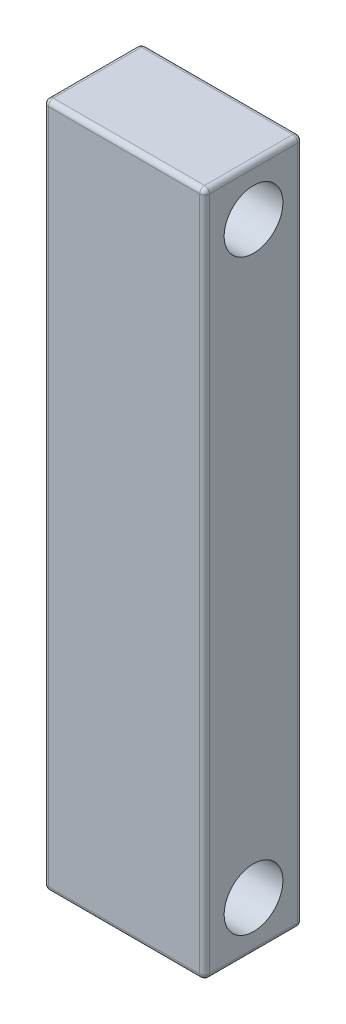
ISO-10303-21;
HEADER;
FILE_DESCRIPTION(('STEP AP214'),'2;1');
FILE_NAME('part.step','',(''),(''),'','','');
FILE_SCHEMA(('AUTOMOTIVE_DESIGN { 1 0 10303 214 1 1 1 1 }'));
ENDSEC;
DATA;
#1=APPLICATION_CONTEXT('core data for automotive mechanical design processes');
#2=APPLICATION_PROTOCOL_DEFINITION('international standard','automotive_design',2000,#1);
#3=PRODUCT_CONTEXT('',#1,'mechanical');
#4=PRODUCT('Part','Part','',(#3));
#5=PRODUCT_RELATED_PRODUCT_CATEGORY('part','',(#4));
#6=PRODUCT_DEFINITION_FORMATION('','',#4);
#7=PRODUCT_DEFINITION_CONTEXT('part definition',#1,'design');
#8=PRODUCT_DEFINITION('design','',#6,#7);
#9=PRODUCT_DEFINITION_SHAPE('','',#8);
#10=(LENGTH_UNIT() NAMED_UNIT(*) SI_UNIT(.MILLI.,.METRE.));
#11=(NAMED_UNIT(*) PLANE_ANGLE_UNIT() SI_UNIT($,.RADIAN.));
#12=(NAMED_UNIT(*) SI_UNIT($,.STERADIAN.) SOLID_ANGLE_UNIT());
#13=UNCERTAINTY_MEASURE_WITH_UNIT(LENGTH_MEASURE(1.E-05),#10,'distance_accuracy_value','');
#14=(GEOMETRIC_REPRESENTATION_CONTEXT(3) GLOBAL_UNCERTAINTY_ASSIGNED_CONTEXT((#13)) GLOBAL_UNIT_ASSIGNED_CONTEXT((#10,
#11,#12)) REPRESENTATION_CONTEXT('',''));
#15=CARTESIAN_POINT('',(0.,0.,0.));
#16=DIRECTION('',(0.,0.,1.));
#17=DIRECTION('',(1.,0.,0.));
#18=AXIS2_PLACEMENT_3D('',#15,#16,#17);
#19=CARTESIAN_POINT('',(16.45,70.,20.));
#20=DIRECTION('',(-1.,0.,0.));
#21=DIRECTION('',(0.,-1.,0.));
#22=AXIS2_PLACEMENT_3D('',#19,#20,#21);
#23=PLANE('',#22);
#24=DIRECTION('',(0.,1.,0.));
#25=VECTOR('',#24,1.);
#26=CARTESIAN_POINT('',(16.45,-70.,19.));
#27=LINE('',#26,#25);
#28=CARTESIAN_POINT('',(16.45,69.,19.));
#29=VERTEX_POINT('',#28);
#30=CARTESIAN_POINT('',(16.45,-69.,19.));
#31=VERTEX_POINT('',#30);
#32=EDGE_CURVE('E192',#29,#31,#27,.F.);
#33=ORIENTED_EDGE('',*,*,#32,.T.);
#34=DIRECTION('',(0.,0.,-1.));
#35=VECTOR('',#34,1.);
#36=CARTESIAN_POINT('',(16.45,-69.,20.));
#37=LINE('',#36,#35);
#38=CARTESIAN_POINT('',(16.45,-69.,1.));
#39=VERTEX_POINT('',#38);
#40=EDGE_CURVE('E196',#31,#39,#37,.T.);
#41=ORIENTED_EDGE('',*,*,#40,.T.);
#42=DIRECTION('',(0.,1.,0.));
#43=VECTOR('',#42,1.);
#44=CARTESIAN_POINT('',(16.45,70.,1.));
#45=LINE('',#44,#43);
#46=CARTESIAN_POINT('',(16.45,69.,1.));
#47=VERTEX_POINT('',#46);
#48=EDGE_CURVE('E194',#39,#47,#45,.T.);
#49=ORIENTED_EDGE('',*,*,#48,.T.);
#50=DIRECTION('',(0.,0.,-1.));
#51=VECTOR('',#50,1.);
#52=CARTESIAN_POINT('',(16.45,69.,20.));
#53=LINE('',#52,#51);
#54=EDGE_CURVE('E190',#47,#29,#53,.F.);
#55=ORIENTED_EDGE('',*,*,#54,.T.);
#56=EDGE_LOOP('',(#33,#41,#49,#55));
#57=FACE_BOUND('',#56,.T.);
#58=CARTESIAN_POINT('',(16.45,-60.,10.));
#59=DIRECTION('',(1.,0.,0.));
#60=DIRECTION('',(0.,1.,0.));
#61=AXIS2_PLACEMENT_3D('',#58,#59,#60);
#62=CIRCLE('',#61,6.);
#63=CARTESIAN_POINT('',(16.45,-54.,10.));
#64=VERTEX_POINT('',#63);
#65=EDGE_CURVE('E258',#64,#64,#62,.T.);
#66=ORIENTED_EDGE('',*,*,#65,.F.);
#67=EDGE_LOOP('',(#66));
#68=FACE_BOUND('',#67,.T.);
#69=CARTESIAN_POINT('',(16.45,60.,10.));
#70=DIRECTION('',(1.,0.,0.));
#71=DIRECTION('',(0.,1.,0.));
#72=AXIS2_PLACEMENT_3D('',#69,#70,#71);
#73=CIRCLE('',#72,6.);
#74=CARTESIAN_POINT('',(16.45,66.,10.));
#75=VERTEX_POINT('',#74);
#76=EDGE_CURVE('E157',#75,#75,#73,.T.);
#77=ORIENTED_EDGE('',*,*,#76,.F.);
#78=EDGE_LOOP('',(#77));
#79=FACE_BOUND('',#78,.T.);
#80=ADVANCED_FACE('F32',(#57,#68,#79),#23,.F.);
#81=CARTESIAN_POINT('',(-16.45,70.,20.));
#82=DIRECTION('',(0.,-1.,0.));
#83=DIRECTION('',(0.,0.,-1.));
#84=AXIS2_PLACEMENT_3D('',#81,#82,#83);
#85=PLANE('',#84);
#86=DIRECTION('',(-1.,0.,0.));
#87=VECTOR('',#86,1.);
#88=CARTESIAN_POINT('',(-16.45,70.,1.));
#89=LINE('',#88,#87);
#90=CARTESIAN_POINT('',(15.45,70.,1.));
#91=VERTEX_POINT('',#90);
#92=CARTESIAN_POINT('',(-15.45,70.,1.));
#93=VERTEX_POINT('',#92);
#94=EDGE_CURVE('E41',#91,#93,#89,.T.);
#95=ORIENTED_EDGE('',*,*,#94,.T.);
#96=DIRECTION('',(0.,0.,-1.));
#97=VECTOR('',#96,1.);
#98=CARTESIAN_POINT('',(-15.45,70.,20.));
#99=LINE('',#98,#97);
#100=CARTESIAN_POINT('',(-15.45,70.,19.));
#101=VERTEX_POINT('',#100);
#102=EDGE_CURVE('E11',#93,#101,#99,.F.);
#103=ORIENTED_EDGE('',*,*,#102,.T.);
#104=DIRECTION('',(-1.,0.,0.));
#105=VECTOR('',#104,1.);
#106=CARTESIAN_POINT('',(16.45,70.,19.));
#107=LINE('',#106,#105);
#108=CARTESIAN_POINT('',(15.45,70.,19.));
#109=VERTEX_POINT('',#108);
#110=EDGE_CURVE('E201',#101,#109,#107,.F.);
#111=ORIENTED_EDGE('',*,*,#110,.T.);
#112=DIRECTION('',(0.,0.,-1.));
#113=VECTOR('',#112,1.);
#114=CARTESIAN_POINT('',(15.45,70.,20.));
#115=LINE('',#114,#113);
#116=EDGE_CURVE('E199',#109,#91,#115,.T.);
#117=ORIENTED_EDGE('',*,*,#116,.T.);
#118=EDGE_LOOP('',(#95,#103,#111,#117));
#119=FACE_BOUND('',#118,.T.);
#120=ADVANCED_FACE('F277',(#119),#85,.F.);
#121=CARTESIAN_POINT('',(-16.45,70.,20.));
#122=DIRECTION('',(1.,0.,0.));
#123=DIRECTION('',(0.,1.,0.));
#124=AXIS2_PLACEMENT_3D('',#121,#122,#123);
#125=PLANE('',#124);
#126=DIRECTION('',(0.,0.,-1.));
#127=VECTOR('',#126,1.);
#128=CARTESIAN_POINT('',(-16.45,69.,20.));
#129=LINE('',#128,#127);
#130=CARTESIAN_POINT('',(-16.45,69.,19.));
#131=VERTEX_POINT('',#130);
#132=CARTESIAN_POINT('',(-16.45,69.,1.));
#133=VERTEX_POINT('',#132);
#134=EDGE_CURVE('E127',#131,#133,#129,.T.);
#135=ORIENTED_EDGE('',*,*,#134,.T.);
#136=DIRECTION('',(0.,-1.,0.));
#137=VECTOR('',#136,1.);
#138=CARTESIAN_POINT('',(-16.45,70.,1.));
#139=LINE('',#138,#137);
#140=CARTESIAN_POINT('',(-16.45,-69.,1.));
#141=VERTEX_POINT('',#140);
#142=EDGE_CURVE('E162',#133,#141,#139,.T.);
#143=ORIENTED_EDGE('',*,*,#142,.T.);
#144=DIRECTION('',(0.,0.,-1.));
#145=VECTOR('',#144,1.);
#146=CARTESIAN_POINT('',(-16.45,-69.,20.));
#147=LINE('',#146,#145);
#148=CARTESIAN_POINT('',(-16.45,-69.,19.));
#149=VERTEX_POINT('',#148);
#150=EDGE_CURVE('E130',#141,#149,#147,.F.);
#151=ORIENTED_EDGE('',*,*,#150,.T.);
#152=DIRECTION('',(0.,-1.,0.));
#153=VECTOR('',#152,1.);
#154=CARTESIAN_POINT('',(-16.45,70.,19.));
#155=LINE('',#154,#153);
#156=EDGE_CURVE('E122',#149,#131,#155,.F.);
#157=ORIENTED_EDGE('',*,*,#156,.T.);
#158=EDGE_LOOP('',(#135,#143,#151,#157));
#159=FACE_BOUND('',#158,.T.);
#160=CARTESIAN_POINT('',(-16.45,-60.,10.));
#161=DIRECTION('',(1.,0.,0.));
#162=DIRECTION('',(0.,1.,0.));
#163=AXIS2_PLACEMENT_3D('',#160,#161,#162);
#164=CIRCLE('',#163,6.);
#165=CARTESIAN_POINT('',(-16.45,-54.,10.));
#166=VERTEX_POINT('',#165);
#167=EDGE_CURVE('E264',#166,#166,#164,.T.);
#168=ORIENTED_EDGE('',*,*,#167,.T.);
#169=EDGE_LOOP('',(#168));
#170=FACE_BOUND('',#169,.T.);
#171=CARTESIAN_POINT('',(-16.45,60.,10.));
#172=DIRECTION('',(1.,0.,0.));
#173=DIRECTION('',(0.,1.,0.));
#174=AXIS2_PLACEMENT_3D('',#171,#172,#173);
#175=CIRCLE('',#174,6.);
#176=CARTESIAN_POINT('',(-16.45,66.,10.));
#177=VERTEX_POINT('',#176);
#178=EDGE_CURVE('E154',#177,#177,#175,.T.);
#179=ORIENTED_EDGE('',*,*,#178,.T.);
#180=EDGE_LOOP('',(#179));
#181=FACE_BOUND('',#180,.T.);
#182=ADVANCED_FACE('F124',(#159,#170,#181),#125,.F.);
#183=CARTESIAN_POINT('',(-16.45,-70.,20.));
#184=DIRECTION('',(0.,1.,0.));
#185=DIRECTION('',(0.,0.,1.));
#186=AXIS2_PLACEMENT_3D('',#183,#184,#185);
#187=PLANE('',#186);
#188=DIRECTION('',(1.,0.,0.));
#189=VECTOR('',#188,1.);
#190=CARTESIAN_POINT('',(-16.45,-70.,19.));
#191=LINE('',#190,#189);
#192=CARTESIAN_POINT('',(15.45,-70.,19.));
#193=VERTEX_POINT('',#192);
#194=CARTESIAN_POINT('',(-15.45,-70.,19.));
#195=VERTEX_POINT('',#194);
#196=EDGE_CURVE('E175',#193,#195,#191,.F.);
#197=ORIENTED_EDGE('',*,*,#196,.T.);
#198=DIRECTION('',(0.,0.,-1.));
#199=VECTOR('',#198,1.);
#200=CARTESIAN_POINT('',(-15.45,-70.,20.));
#201=LINE('',#200,#199);
#202=CARTESIAN_POINT('',(-15.45,-70.,1.));
#203=VERTEX_POINT('',#202);
#204=EDGE_CURVE('E179',#195,#203,#201,.T.);
#205=ORIENTED_EDGE('',*,*,#204,.T.);
#206=DIRECTION('',(1.,0.,0.));
#207=VECTOR('',#206,1.);
#208=CARTESIAN_POINT('',(-16.45,-70.,1.));
#209=LINE('',#208,#207);
#210=CARTESIAN_POINT('',(15.45,-70.,1.));
#211=VERTEX_POINT('',#210);
#212=EDGE_CURVE('E177',#203,#211,#209,.T.);
#213=ORIENTED_EDGE('',*,*,#212,.T.);
#214=DIRECTION('',(0.,0.,-1.));
#215=VECTOR('',#214,1.);
#216=CARTESIAN_POINT('',(15.45,-70.,20.));
#217=LINE('',#216,#215);
#218=EDGE_CURVE('E173',#211,#193,#217,.F.);
#219=ORIENTED_EDGE('',*,*,#218,.T.);
#220=EDGE_LOOP('',(#197,#205,#213,#219));
#221=FACE_BOUND('',#220,.T.);
#222=ADVANCED_FACE('F398',(#221),#187,.F.);
#223=CARTESIAN_POINT('',(0.,0.,20.));
#224=DIRECTION('',(0.,0.,1.));
#225=DIRECTION('',(1.,0.,0.));
#226=AXIS2_PLACEMENT_3D('',#223,#224,#225);
#227=PLANE('',#226);
#228=DIRECTION('',(0.,-1.,0.));
#229=VECTOR('',#228,1.);
#230=CARTESIAN_POINT('',(-15.45,-70.,20.));
#231=LINE('',#230,#229);
#232=CARTESIAN_POINT('',(-15.45,69.,20.));
#233=VERTEX_POINT('',#232);
#234=CARTESIAN_POINT('',(-15.45,-69.,20.));
#235=VERTEX_POINT('',#234);
#236=EDGE_CURVE('E139',#233,#235,#231,.T.);
#237=ORIENTED_EDGE('',*,*,#236,.T.);
#238=DIRECTION('',(1.,0.,0.));
#239=VECTOR('',#238,1.);
#240=CARTESIAN_POINT('',(16.45,-69.,20.));
#241=LINE('',#240,#239);
#242=CARTESIAN_POINT('',(15.45,-69.,20.));
#243=VERTEX_POINT('',#242);
#244=EDGE_CURVE('E187',#235,#243,#241,.T.);
#245=ORIENTED_EDGE('',*,*,#244,.T.);
#246=DIRECTION('',(0.,1.,0.));
#247=VECTOR('',#246,1.);
#248=CARTESIAN_POINT('',(15.45,70.,20.));
#249=LINE('',#248,#247);
#250=CARTESIAN_POINT('',(15.45,69.,20.));
#251=VERTEX_POINT('',#250);
#252=EDGE_CURVE('E184',#243,#251,#249,.T.);
#253=ORIENTED_EDGE('',*,*,#252,.T.);
#254=DIRECTION('',(-1.,0.,0.));
#255=VECTOR('',#254,1.);
#256=CARTESIAN_POINT('',(-16.45,69.,20.));
#257=LINE('',#256,#255);
#258=EDGE_CURVE('E182',#251,#233,#257,.T.);
#259=ORIENTED_EDGE('',*,*,#258,.T.);
#260=EDGE_LOOP('',(#237,#245,#253,#259));
#261=FACE_BOUND('',#260,.T.);
#262=ADVANCED_FACE('F361',(#261),#227,.T.);
#263=CARTESIAN_POINT('',(0.,0.,0.));
#264=DIRECTION('',(0.,0.,1.));
#265=DIRECTION('',(1.,0.,0.));
#266=AXIS2_PLACEMENT_3D('',#263,#264,#265);
#267=PLANE('',#266);
#268=DIRECTION('',(1.,0.,0.));
#269=VECTOR('',#268,1.);
#270=CARTESIAN_POINT('',(0.,-69.,0.));
#271=LINE('',#270,#269);
#272=CARTESIAN_POINT('',(15.45,-69.,0.));
#273=VERTEX_POINT('',#272);
#274=CARTESIAN_POINT('',(-15.45,-69.,0.));
#275=VERTEX_POINT('',#274);
#276=EDGE_CURVE('E168',#273,#275,#271,.F.);
#277=ORIENTED_EDGE('',*,*,#276,.T.);
#278=DIRECTION('',(0.,-1.,0.));
#279=VECTOR('',#278,1.);
#280=CARTESIAN_POINT('',(-15.45,0.,0.));
#281=LINE('',#280,#279);
#282=CARTESIAN_POINT('',(-15.45,69.,0.));
#283=VERTEX_POINT('',#282);
#284=EDGE_CURVE('E170',#275,#283,#281,.F.);
#285=ORIENTED_EDGE('',*,*,#284,.T.);
#286=DIRECTION('',(-1.,0.,0.));
#287=VECTOR('',#286,1.);
#288=CARTESIAN_POINT('',(0.,69.,0.));
#289=LINE('',#288,#287);
#290=CARTESIAN_POINT('',(15.45,69.,0.));
#291=VERTEX_POINT('',#290);
#292=EDGE_CURVE('E166',#283,#291,#289,.F.);
#293=ORIENTED_EDGE('',*,*,#292,.T.);
#294=DIRECTION('',(0.,1.,0.));
#295=VECTOR('',#294,1.);
#296=CARTESIAN_POINT('',(15.45,0.,0.));
#297=LINE('',#296,#295);
#298=EDGE_CURVE('E164',#291,#273,#297,.F.);
#299=ORIENTED_EDGE('',*,*,#298,.T.);
#300=EDGE_LOOP('',(#277,#285,#293,#299));
#301=FACE_BOUND('',#300,.T.);
#302=ADVANCED_FACE('F389',(#301),#267,.F.);
#303=CARTESIAN_POINT('',(-16.45,60.,10.));
#304=DIRECTION('',(1.,0.,0.));
#305=DIRECTION('',(0.,1.,0.));
#306=AXIS2_PLACEMENT_3D('',#303,#304,#305);
#307=CYLINDRICAL_SURFACE('',#306,6.);
#308=ORIENTED_EDGE('',*,*,#178,.F.);
#309=EDGE_LOOP('',(#308));
#310=FACE_BOUND('',#309,.T.);
#311=ORIENTED_EDGE('',*,*,#76,.T.);
#312=EDGE_LOOP('',(#311));
#313=FACE_BOUND('',#312,.T.);
#314=ADVANCED_FACE('F274',(#310,#313),#307,.F.);
#315=CARTESIAN_POINT('',(-16.45,-60.,10.));
#316=DIRECTION('',(1.,0.,0.));
#317=DIRECTION('',(0.,1.,0.));
#318=AXIS2_PLACEMENT_3D('',#315,#316,#317);
#319=CYLINDRICAL_SURFACE('',#318,6.);
#320=ORIENTED_EDGE('',*,*,#167,.F.);
#321=EDGE_LOOP('',(#320));
#322=FACE_BOUND('',#321,.T.);
#323=ORIENTED_EDGE('',*,*,#65,.T.);
#324=EDGE_LOOP('',(#323));
#325=FACE_BOUND('',#324,.T.);
#326=ADVANCED_FACE('F356',(#322,#325),#319,.F.);
#327=CARTESIAN_POINT('',(15.45,0.,19.));
#328=DIRECTION('',(0.,-1.,0.));
#329=DIRECTION('',(1.,0.,0.));
#330=AXIS2_PLACEMENT_3D('',#327,#328,#329);
#331=CYLINDRICAL_SURFACE('',#330,1.);
#332=CARTESIAN_POINT('',(15.45,69.,19.));
#333=DIRECTION('',(0.,1.,0.));
#334=DIRECTION('',(0.,0.,1.));
#335=AXIS2_PLACEMENT_3D('',#332,#333,#334);
#336=CIRCLE('',#335,1.);
#337=EDGE_CURVE('E36',#251,#29,#336,.T.);
#338=ORIENTED_EDGE('',*,*,#337,.F.);
#339=ORIENTED_EDGE('',*,*,#252,.F.);
#340=CARTESIAN_POINT('',(15.45,-69.,19.));
#341=DIRECTION('',(0.,-1.,0.));
#342=DIRECTION('',(0.,0.,-1.));
#343=AXIS2_PLACEMENT_3D('',#340,#341,#342);
#344=CIRCLE('',#343,1.);
#345=EDGE_CURVE('E250',#31,#243,#344,.T.);
#346=ORIENTED_EDGE('',*,*,#345,.F.);
#347=ORIENTED_EDGE('',*,*,#32,.F.);
#348=EDGE_LOOP('',(#338,#339,#346,#347));
#349=FACE_BOUND('',#348,.T.);
#350=ADVANCED_FACE('F34',(#349),#331,.T.);
#351=CARTESIAN_POINT('',(15.45,69.,19.));
#352=DIRECTION('',(0.,0.,1.));
#353=DIRECTION('',(1.,0.,0.));
#354=AXIS2_PLACEMENT_3D('',#351,#352,#353);
#355=SPHERICAL_SURFACE('',#354,1.);
#356=CARTESIAN_POINT('',(15.45,69.,19.));
#357=DIRECTION('',(1.,0.,0.));
#358=DIRECTION('',(0.,0.,-1.));
#359=AXIS2_PLACEMENT_3D('',#356,#357,#358);
#360=CIRCLE('',#359,1.);
#361=EDGE_CURVE('E245',#251,#109,#360,.F.);
#362=ORIENTED_EDGE('',*,*,#361,.F.);
#363=ORIENTED_EDGE('',*,*,#337,.T.);
#364=CARTESIAN_POINT('',(15.45,69.,19.));
#365=DIRECTION('',(0.,0.,1.));
#366=DIRECTION('',(1.,0.,0.));
#367=AXIS2_PLACEMENT_3D('',#364,#365,#366);
#368=CIRCLE('',#367,1.);
#369=EDGE_CURVE('E248',#109,#29,#368,.F.);
#370=ORIENTED_EDGE('',*,*,#369,.F.);
#371=EDGE_LOOP('',(#362,#363,#370));
#372=FACE_BOUND('',#371,.T.);
#373=ADVANCED_FACE('F351',(#372),#355,.T.);
#374=CARTESIAN_POINT('',(15.45,-69.,19.));
#375=DIRECTION('',(0.,0.,1.));
#376=DIRECTION('',(1.,0.,0.));
#377=AXIS2_PLACEMENT_3D('',#374,#375,#376);
#378=SPHERICAL_SURFACE('',#377,1.);
#379=CARTESIAN_POINT('',(15.45,-69.,19.));
#380=DIRECTION('',(0.,0.,1.));
#381=DIRECTION('',(1.,0.,0.));
#382=AXIS2_PLACEMENT_3D('',#379,#380,#381);
#383=CIRCLE('',#382,1.);
#384=EDGE_CURVE('E240',#31,#193,#383,.F.);
#385=ORIENTED_EDGE('',*,*,#384,.F.);
#386=ORIENTED_EDGE('',*,*,#345,.T.);
#387=CARTESIAN_POINT('',(15.45,-69.,19.));
#388=DIRECTION('',(1.,0.,0.));
#389=DIRECTION('',(0.,0.,-1.));
#390=AXIS2_PLACEMENT_3D('',#387,#388,#389);
#391=CIRCLE('',#390,1.);
#392=EDGE_CURVE('E243',#193,#243,#391,.F.);
#393=ORIENTED_EDGE('',*,*,#392,.F.);
#394=EDGE_LOOP('',(#385,#386,#393));
#395=FACE_BOUND('',#394,.T.);
#396=ADVANCED_FACE('F348',(#395),#378,.T.);
#397=CARTESIAN_POINT('',(15.45,69.,20.));
#398=DIRECTION('',(0.,0.,-1.));
#399=DIRECTION('',(-1.,0.,0.));
#400=AXIS2_PLACEMENT_3D('',#397,#398,#399);
#401=CYLINDRICAL_SURFACE('',#400,1.);
#402=ORIENTED_EDGE('',*,*,#369,.T.);
#403=ORIENTED_EDGE('',*,*,#54,.F.);
#404=CARTESIAN_POINT('',(15.45,69.,1.));
#405=DIRECTION('',(0.,0.,-1.));
#406=DIRECTION('',(-1.,0.,0.));
#407=AXIS2_PLACEMENT_3D('',#404,#405,#406);
#408=CIRCLE('',#407,1.);
#409=EDGE_CURVE('E234',#91,#47,#408,.T.);
#410=ORIENTED_EDGE('',*,*,#409,.F.);
#411=ORIENTED_EDGE('',*,*,#116,.F.);
#412=EDGE_LOOP('',(#402,#403,#410,#411));
#413=FACE_BOUND('',#412,.T.);
#414=ADVANCED_FACE('F344',(#413),#401,.T.);
#415=CARTESIAN_POINT('',(0.,69.,19.));
#416=DIRECTION('',(1.,0.,0.));
#417=DIRECTION('',(0.,0.,-1.));
#418=AXIS2_PLACEMENT_3D('',#415,#416,#417);
#419=CYLINDRICAL_SURFACE('',#418,1.);
#420=ORIENTED_EDGE('',*,*,#361,.T.);
#421=ORIENTED_EDGE('',*,*,#110,.F.);
#422=CARTESIAN_POINT('',(-15.45,69.,19.));
#423=DIRECTION('',(-1.,0.,0.));
#424=DIRECTION('',(0.,0.,1.));
#425=AXIS2_PLACEMENT_3D('',#422,#423,#424);
#426=CIRCLE('',#425,1.);
#427=EDGE_CURVE('E142',#233,#101,#426,.T.);
#428=ORIENTED_EDGE('',*,*,#427,.F.);
#429=ORIENTED_EDGE('',*,*,#258,.F.);
#430=EDGE_LOOP('',(#420,#421,#428,#429));
#431=FACE_BOUND('',#430,.T.);
#432=ADVANCED_FACE('F341',(#431),#419,.T.);
#433=CARTESIAN_POINT('',(-15.45,0.,19.));
#434=DIRECTION('',(0.,1.,0.));
#435=DIRECTION('',(-1.,0.,0.));
#436=AXIS2_PLACEMENT_3D('',#433,#434,#435);
#437=CYLINDRICAL_SURFACE('',#436,1.);
#438=CARTESIAN_POINT('',(-15.45,-69.,19.));
#439=DIRECTION('',(0.,-1.,0.));
#440=DIRECTION('',(0.,0.,-1.));
#441=AXIS2_PLACEMENT_3D('',#438,#439,#440);
#442=CIRCLE('',#441,1.);
#443=EDGE_CURVE('E143',#235,#149,#442,.T.);
#444=ORIENTED_EDGE('',*,*,#443,.F.);
#445=ORIENTED_EDGE('',*,*,#236,.F.);
#446=CARTESIAN_POINT('',(-15.45,69.,19.));
#447=DIRECTION('',(0.,1.,0.));
#448=DIRECTION('',(0.,0.,1.));
#449=AXIS2_PLACEMENT_3D('',#446,#447,#448);
#450=CIRCLE('',#449,1.);
#451=EDGE_CURVE('E137',#131,#233,#450,.T.);
#452=ORIENTED_EDGE('',*,*,#451,.F.);
#453=ORIENTED_EDGE('',*,*,#156,.F.);
#454=EDGE_LOOP('',(#444,#445,#452,#453));
#455=FACE_BOUND('',#454,.T.);
#456=ADVANCED_FACE('F138',(#455),#437,.T.);
#457=CARTESIAN_POINT('',(0.,-69.,19.));
#458=DIRECTION('',(-1.,0.,0.));
#459=DIRECTION('',(0.,0.,1.));
#460=AXIS2_PLACEMENT_3D('',#457,#458,#459);
#461=CYLINDRICAL_SURFACE('',#460,1.);
#462=ORIENTED_EDGE('',*,*,#392,.T.);
#463=ORIENTED_EDGE('',*,*,#244,.F.);
#464=CARTESIAN_POINT('',(-15.45,-69.,19.));
#465=DIRECTION('',(-1.,0.,0.));
#466=DIRECTION('',(0.,0.,1.));
#467=AXIS2_PLACEMENT_3D('',#464,#465,#466);
#468=CIRCLE('',#467,1.);
#469=EDGE_CURVE('E229',#195,#235,#468,.T.);
#470=ORIENTED_EDGE('',*,*,#469,.F.);
#471=ORIENTED_EDGE('',*,*,#196,.F.);
#472=EDGE_LOOP('',(#462,#463,#470,#471));
#473=FACE_BOUND('',#472,.T.);
#474=ADVANCED_FACE('F334',(#473),#461,.T.);
#475=CARTESIAN_POINT('',(15.45,-69.,20.));
#476=DIRECTION('',(0.,0.,-1.));
#477=DIRECTION('',(-1.,0.,0.));
#478=AXIS2_PLACEMENT_3D('',#475,#476,#477);
#479=CYLINDRICAL_SURFACE('',#478,1.);
#480=ORIENTED_EDGE('',*,*,#384,.T.);
#481=ORIENTED_EDGE('',*,*,#218,.F.);
#482=CARTESIAN_POINT('',(15.45,-69.,1.));
#483=DIRECTION('',(0.,0.,-1.));
#484=DIRECTION('',(-1.,0.,0.));
#485=AXIS2_PLACEMENT_3D('',#482,#483,#484);
#486=CIRCLE('',#485,1.);
#487=EDGE_CURVE('E226',#39,#211,#486,.T.);
#488=ORIENTED_EDGE('',*,*,#487,.F.);
#489=ORIENTED_EDGE('',*,*,#40,.F.);
#490=EDGE_LOOP('',(#480,#481,#488,#489));
#491=FACE_BOUND('',#490,.T.);
#492=ADVANCED_FACE('F330',(#491),#479,.T.);
#493=CARTESIAN_POINT('',(15.45,70.,1.));
#494=DIRECTION('',(0.,1.,0.));
#495=DIRECTION('',(-1.,0.,0.));
#496=AXIS2_PLACEMENT_3D('',#493,#494,#495);
#497=CYLINDRICAL_SURFACE('',#496,1.);
#498=CARTESIAN_POINT('',(15.45,69.,1.));
#499=DIRECTION('',(0.,1.,0.));
#500=DIRECTION('',(0.,0.,1.));
#501=AXIS2_PLACEMENT_3D('',#498,#499,#500);
#502=CIRCLE('',#501,1.);
#503=EDGE_CURVE('E237',#47,#291,#502,.T.);
#504=ORIENTED_EDGE('',*,*,#503,.F.);
#505=ORIENTED_EDGE('',*,*,#48,.F.);
#506=CARTESIAN_POINT('',(15.45,-69.,1.));
#507=DIRECTION('',(0.,-1.,0.));
#508=DIRECTION('',(0.,0.,-1.));
#509=AXIS2_PLACEMENT_3D('',#506,#507,#508);
#510=CIRCLE('',#509,1.);
#511=EDGE_CURVE('E224',#273,#39,#510,.T.);
#512=ORIENTED_EDGE('',*,*,#511,.F.);
#513=ORIENTED_EDGE('',*,*,#298,.F.);
#514=EDGE_LOOP('',(#504,#505,#512,#513));
#515=FACE_BOUND('',#514,.T.);
#516=ADVANCED_FACE('F326',(#515),#497,.T.);
#517=CARTESIAN_POINT('',(15.45,69.,1.));
#518=DIRECTION('',(0.,0.,1.));
#519=DIRECTION('',(1.,0.,0.));
#520=AXIS2_PLACEMENT_3D('',#517,#518,#519);
#521=SPHERICAL_SURFACE('',#520,1.);
#522=ORIENTED_EDGE('',*,*,#409,.T.);
#523=ORIENTED_EDGE('',*,*,#503,.T.);
#524=CARTESIAN_POINT('',(15.45,69.,1.));
#525=DIRECTION('',(1.,0.,0.));
#526=DIRECTION('',(0.,0.,-1.));
#527=AXIS2_PLACEMENT_3D('',#524,#525,#526);
#528=CIRCLE('',#527,1.);
#529=EDGE_CURVE('E147',#91,#291,#528,.F.);
#530=ORIENTED_EDGE('',*,*,#529,.F.);
#531=EDGE_LOOP('',(#522,#523,#530));
#532=FACE_BOUND('',#531,.T.);
#533=ADVANCED_FACE('F323',(#532),#521,.T.);
#534=CARTESIAN_POINT('',(-15.45,69.,19.));
#535=DIRECTION('',(0.,0.,1.));
#536=DIRECTION('',(1.,0.,0.));
#537=AXIS2_PLACEMENT_3D('',#534,#535,#536);
#538=SPHERICAL_SURFACE('',#537,1.);
#539=ORIENTED_EDGE('',*,*,#451,.T.);
#540=ORIENTED_EDGE('',*,*,#427,.T.);
#541=CARTESIAN_POINT('',(-15.45,69.,19.));
#542=DIRECTION('',(0.,0.,1.));
#543=DIRECTION('',(1.,0.,0.));
#544=AXIS2_PLACEMENT_3D('',#541,#542,#543);
#545=CIRCLE('',#544,1.);
#546=EDGE_CURVE('E54',#131,#101,#545,.F.);
#547=ORIENTED_EDGE('',*,*,#546,.F.);
#548=EDGE_LOOP('',(#539,#540,#547));
#549=FACE_BOUND('',#548,.T.);
#550=ADVANCED_FACE('F145',(#549),#538,.T.);
#551=CARTESIAN_POINT('',(-15.45,-69.,19.));
#552=DIRECTION('',(0.,0.,1.));
#553=DIRECTION('',(1.,0.,0.));
#554=AXIS2_PLACEMENT_3D('',#551,#552,#553);
#555=SPHERICAL_SURFACE('',#554,1.);
#556=ORIENTED_EDGE('',*,*,#469,.T.);
#557=ORIENTED_EDGE('',*,*,#443,.T.);
#558=CARTESIAN_POINT('',(-15.45,-69.,19.));
#559=DIRECTION('',(0.,0.,1.));
#560=DIRECTION('',(1.,0.,0.));
#561=AXIS2_PLACEMENT_3D('',#558,#559,#560);
#562=CIRCLE('',#561,1.);
#563=EDGE_CURVE('E148',#195,#149,#562,.F.);
#564=ORIENTED_EDGE('',*,*,#563,.F.);
#565=EDGE_LOOP('',(#556,#557,#564));
#566=FACE_BOUND('',#565,.T.);
#567=ADVANCED_FACE('F316',(#566),#555,.T.);
#568=CARTESIAN_POINT('',(15.45,-69.,1.));
#569=DIRECTION('',(0.,0.,1.));
#570=DIRECTION('',(1.,0.,0.));
#571=AXIS2_PLACEMENT_3D('',#568,#569,#570);
#572=SPHERICAL_SURFACE('',#571,1.);
#573=ORIENTED_EDGE('',*,*,#511,.T.);
#574=ORIENTED_EDGE('',*,*,#487,.T.);
#575=CARTESIAN_POINT('',(15.45,-69.,1.));
#576=DIRECTION('',(1.,0.,0.));
#577=DIRECTION('',(0.,0.,-1.));
#578=AXIS2_PLACEMENT_3D('',#575,#576,#577);
#579=CIRCLE('',#578,1.);
#580=EDGE_CURVE('E217',#273,#211,#579,.F.);
#581=ORIENTED_EDGE('',*,*,#580,.F.);
#582=EDGE_LOOP('',(#573,#574,#581));
#583=FACE_BOUND('',#582,.T.);
#584=ADVANCED_FACE('F312',(#583),#572,.T.);
#585=CARTESIAN_POINT('',(-16.45,69.,1.));
#586=DIRECTION('',(-1.,0.,0.));
#587=DIRECTION('',(0.,0.,1.));
#588=AXIS2_PLACEMENT_3D('',#585,#586,#587);
#589=CYLINDRICAL_SURFACE('',#588,1.);
#590=ORIENTED_EDGE('',*,*,#529,.T.);
#591=ORIENTED_EDGE('',*,*,#292,.F.);
#592=CARTESIAN_POINT('',(-15.45,69.,1.));
#593=DIRECTION('',(-1.,0.,0.));
#594=DIRECTION('',(0.,0.,1.));
#595=AXIS2_PLACEMENT_3D('',#592,#593,#594);
#596=CIRCLE('',#595,1.);
#597=EDGE_CURVE('E214',#93,#283,#596,.T.);
#598=ORIENTED_EDGE('',*,*,#597,.F.);
#599=ORIENTED_EDGE('',*,*,#94,.F.);
#600=EDGE_LOOP('',(#590,#591,#598,#599));
#601=FACE_BOUND('',#600,.T.);
#602=ADVANCED_FACE('F309',(#601),#589,.T.);
#603=CARTESIAN_POINT('',(-15.45,69.,20.));
#604=DIRECTION('',(0.,0.,-1.));
#605=DIRECTION('',(-1.,0.,0.));
#606=AXIS2_PLACEMENT_3D('',#603,#604,#605);
#607=CYLINDRICAL_SURFACE('',#606,1.);
#608=ORIENTED_EDGE('',*,*,#546,.T.);
#609=ORIENTED_EDGE('',*,*,#102,.F.);
#610=CARTESIAN_POINT('',(-15.45,69.,1.));
#611=DIRECTION('',(0.,0.,-1.));
#612=DIRECTION('',(-1.,0.,0.));
#613=AXIS2_PLACEMENT_3D('',#610,#611,#612);
#614=CIRCLE('',#613,1.);
#615=EDGE_CURVE('E152',#133,#93,#614,.T.);
#616=ORIENTED_EDGE('',*,*,#615,.F.);
#617=ORIENTED_EDGE('',*,*,#134,.F.);
#618=EDGE_LOOP('',(#608,#609,#616,#617));
#619=FACE_BOUND('',#618,.T.);
#620=ADVANCED_FACE('F150',(#619),#607,.T.);
#621=CARTESIAN_POINT('',(-15.45,-69.,20.));
#622=DIRECTION('',(0.,0.,-1.));
#623=DIRECTION('',(-1.,0.,0.));
#624=AXIS2_PLACEMENT_3D('',#621,#622,#623);
#625=CYLINDRICAL_SURFACE('',#624,1.);
#626=ORIENTED_EDGE('',*,*,#563,.T.);
#627=ORIENTED_EDGE('',*,*,#150,.F.);
#628=CARTESIAN_POINT('',(-15.45,-69.,1.));
#629=DIRECTION('',(0.,0.,-1.));
#630=DIRECTION('',(-1.,0.,0.));
#631=AXIS2_PLACEMENT_3D('',#628,#629,#630);
#632=CIRCLE('',#631,1.);
#633=EDGE_CURVE('E210',#203,#141,#632,.T.);
#634=ORIENTED_EDGE('',*,*,#633,.F.);
#635=ORIENTED_EDGE('',*,*,#204,.F.);
#636=EDGE_LOOP('',(#626,#627,#634,#635));
#637=FACE_BOUND('',#636,.T.);
#638=ADVANCED_FACE('F302',(#637),#625,.T.);
#639=CARTESIAN_POINT('',(-16.45,-69.,1.));
#640=DIRECTION('',(1.,0.,0.));
#641=DIRECTION('',(0.,0.,-1.));
#642=AXIS2_PLACEMENT_3D('',#639,#640,#641);
#643=CYLINDRICAL_SURFACE('',#642,1.);
#644=ORIENTED_EDGE('',*,*,#580,.T.);
#645=ORIENTED_EDGE('',*,*,#212,.F.);
#646=CARTESIAN_POINT('',(-15.45,-69.,1.));
#647=DIRECTION('',(-1.,0.,0.));
#648=DIRECTION('',(0.,0.,1.));
#649=AXIS2_PLACEMENT_3D('',#646,#647,#648);
#650=CIRCLE('',#649,1.);
#651=EDGE_CURVE('E208',#275,#203,#650,.T.);
#652=ORIENTED_EDGE('',*,*,#651,.F.);
#653=ORIENTED_EDGE('',*,*,#276,.F.);
#654=EDGE_LOOP('',(#644,#645,#652,#653));
#655=FACE_BOUND('',#654,.T.);
#656=ADVANCED_FACE('F298',(#655),#643,.T.);
#657=CARTESIAN_POINT('',(-15.45,69.,1.));
#658=DIRECTION('',(0.,0.,1.));
#659=DIRECTION('',(1.,0.,0.));
#660=AXIS2_PLACEMENT_3D('',#657,#658,#659);
#661=SPHERICAL_SURFACE('',#660,1.);
#662=ORIENTED_EDGE('',*,*,#615,.T.);
#663=ORIENTED_EDGE('',*,*,#597,.T.);
#664=CARTESIAN_POINT('',(-15.45,69.,1.));
#665=DIRECTION('',(0.,1.,0.));
#666=DIRECTION('',(0.,0.,1.));
#667=AXIS2_PLACEMENT_3D('',#664,#665,#666);
#668=CIRCLE('',#667,1.);
#669=EDGE_CURVE('E206',#133,#283,#668,.F.);
#670=ORIENTED_EDGE('',*,*,#669,.F.);
#671=EDGE_LOOP('',(#662,#663,#670));
#672=FACE_BOUND('',#671,.T.);
#673=ADVANCED_FACE('F294',(#672),#661,.T.);
#674=CARTESIAN_POINT('',(-15.45,-69.,1.));
#675=DIRECTION('',(0.,0.,1.));
#676=DIRECTION('',(1.,0.,0.));
#677=AXIS2_PLACEMENT_3D('',#674,#675,#676);
#678=SPHERICAL_SURFACE('',#677,1.);
#679=ORIENTED_EDGE('',*,*,#651,.T.);
#680=ORIENTED_EDGE('',*,*,#633,.T.);
#681=CARTESIAN_POINT('',(-15.45,-69.,1.));
#682=DIRECTION('',(0.,-1.,0.));
#683=DIRECTION('',(0.,0.,-1.));
#684=AXIS2_PLACEMENT_3D('',#681,#682,#683);
#685=CIRCLE('',#684,1.);
#686=EDGE_CURVE('E204',#275,#141,#685,.F.);
#687=ORIENTED_EDGE('',*,*,#686,.F.);
#688=EDGE_LOOP('',(#679,#680,#687));
#689=FACE_BOUND('',#688,.T.);
#690=ADVANCED_FACE('F290',(#689),#678,.T.);
#691=CARTESIAN_POINT('',(-15.45,70.,1.));
#692=DIRECTION('',(0.,-1.,0.));
#693=DIRECTION('',(1.,0.,0.));
#694=AXIS2_PLACEMENT_3D('',#691,#692,#693);
#695=CYLINDRICAL_SURFACE('',#694,1.);
#696=ORIENTED_EDGE('',*,*,#669,.T.);
#697=ORIENTED_EDGE('',*,*,#284,.F.);
#698=ORIENTED_EDGE('',*,*,#686,.T.);
#699=ORIENTED_EDGE('',*,*,#142,.F.);
#700=EDGE_LOOP('',(#696,#697,#698,#699));
#701=FACE_BOUND('',#700,.T.);
#702=ADVANCED_FACE('F287',(#701),#695,.T.);
#703=CLOSED_SHELL('',(#80,#120,#182,#222,#262,#302,#314,#326,#350,#373,#396,#414,#432,#456,#474,
#492,#516,#533,#550,#567,#584,#602,#620,#638,#656,#673,#690,#702));
#704=MANIFOLD_SOLID_BREP('B2',#703);
#705=ADVANCED_BREP_SHAPE_REPRESENTATION('',(#18,#704),#14);
#706=SHAPE_DEFINITION_REPRESENTATION(#9,#705);
ENDSEC;
END-ISO-10303-21;
